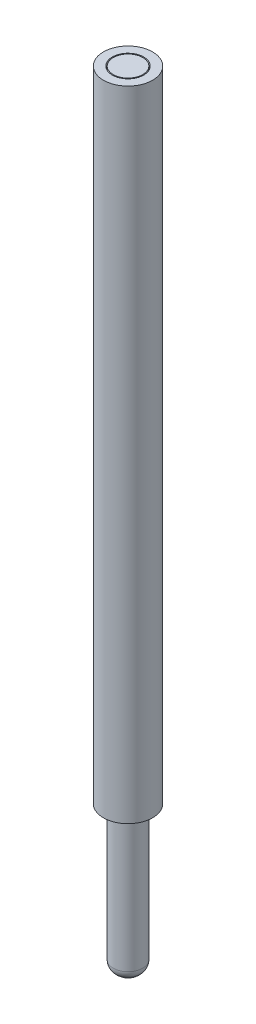
ISO-10303-21;
HEADER;
FILE_DESCRIPTION(('STEP AP214'),'2;1');
FILE_NAME('part.step','',(''),(''),'','','');
FILE_SCHEMA(('AUTOMOTIVE_DESIGN { 1 0 10303 214 1 1 1 1 }'));
ENDSEC;
DATA;
#1=APPLICATION_CONTEXT('core data for automotive mechanical design processes');
#2=APPLICATION_PROTOCOL_DEFINITION('international standard','automotive_design',2000,#1);
#3=PRODUCT_CONTEXT('',#1,'mechanical');
#4=PRODUCT('Part','Part','',(#3));
#5=PRODUCT_RELATED_PRODUCT_CATEGORY('part','',(#4));
#6=PRODUCT_DEFINITION_FORMATION('','',#4);
#7=PRODUCT_DEFINITION_CONTEXT('part definition',#1,'design');
#8=PRODUCT_DEFINITION('design','',#6,#7);
#9=PRODUCT_DEFINITION_SHAPE('','',#8);
#10=(LENGTH_UNIT() NAMED_UNIT(*) SI_UNIT(.MILLI.,.METRE.));
#11=(NAMED_UNIT(*) PLANE_ANGLE_UNIT() SI_UNIT($,.RADIAN.));
#12=(NAMED_UNIT(*) SI_UNIT($,.STERADIAN.) SOLID_ANGLE_UNIT());
#13=UNCERTAINTY_MEASURE_WITH_UNIT(LENGTH_MEASURE(1.E-05),#10,'distance_accuracy_value','');
#14=(GEOMETRIC_REPRESENTATION_CONTEXT(3) GLOBAL_UNCERTAINTY_ASSIGNED_CONTEXT((#13)) GLOBAL_UNIT_ASSIGNED_CONTEXT((#10,
#11,#12)) REPRESENTATION_CONTEXT('',''));
#15=CARTESIAN_POINT('',(0.,0.,0.));
#16=DIRECTION('',(0.,0.,1.));
#17=DIRECTION('',(1.,0.,0.));
#18=AXIS2_PLACEMENT_3D('',#15,#16,#17);
#19=CARTESIAN_POINT('',(0.,0.,0.));
#20=DIRECTION('',(0.,-1.,0.));
#21=DIRECTION('',(0.,0.,-1.));
#22=AXIS2_PLACEMENT_3D('',#19,#20,#21);
#23=CYLINDRICAL_SURFACE('',#22,0.799999999999999);
#24=CARTESIAN_POINT('',(0.,7.5,0.));
#25=DIRECTION('',(0.,-1.,0.));
#26=DIRECTION('',(0.,0.,-1.));
#27=AXIS2_PLACEMENT_3D('',#24,#25,#26);
#28=CIRCLE('',#27,0.800000000000001);
#29=CARTESIAN_POINT('',(0.,7.5,-0.800000000000001));
#30=VERTEX_POINT('',#29);
#31=EDGE_CURVE('E11',#30,#30,#28,.T.);
#32=ORIENTED_EDGE('',*,*,#31,.T.);
#33=EDGE_LOOP('',(#32));
#34=FACE_BOUND('',#33,.T.);
#35=CARTESIAN_POINT('',(0.,40.,0.));
#36=DIRECTION('',(0.,-1.,0.));
#37=DIRECTION('',(0.,0.,-1.));
#38=AXIS2_PLACEMENT_3D('',#35,#36,#37);
#39=CIRCLE('',#38,0.799999999999997);
#40=CARTESIAN_POINT('',(0.,40.,-0.799999999999997));
#41=VERTEX_POINT('',#40);
#42=EDGE_CURVE('E54',#41,#41,#39,.T.);
#43=ORIENTED_EDGE('',*,*,#42,.F.);
#44=EDGE_LOOP('',(#43));
#45=FACE_BOUND('',#44,.T.);
#46=ADVANCED_FACE('F40',(#34,#45),#23,.F.);
#47=CARTESIAN_POINT('',(0.800000000000001,7.5,0.));
#48=DIRECTION('',(0.,-1.,0.));
#49=DIRECTION('',(0.,0.,-1.));
#50=AXIS2_PLACEMENT_3D('',#47,#48,#49);
#51=PLANE('',#50);
#52=CARTESIAN_POINT('',(0.,7.5,0.));
#53=DIRECTION('',(0.,-1.,0.));
#54=DIRECTION('',(0.,0.,-1.));
#55=AXIS2_PLACEMENT_3D('',#52,#53,#54);
#56=CIRCLE('',#55,1.25);
#57=CARTESIAN_POINT('',(0.,7.5,-1.25));
#58=VERTEX_POINT('',#57);
#59=EDGE_CURVE('E46',#58,#58,#56,.T.);
#60=ORIENTED_EDGE('',*,*,#59,.T.);
#61=EDGE_LOOP('',(#60));
#62=FACE_BOUND('',#61,.T.);
#63=ORIENTED_EDGE('',*,*,#31,.F.);
#64=EDGE_LOOP('',(#63));
#65=FACE_BOUND('',#64,.T.);
#66=ADVANCED_FACE('F64',(#62,#65),#51,.T.);
#67=CARTESIAN_POINT('',(0.,0.,0.));
#68=DIRECTION('',(0.,-1.,0.));
#69=DIRECTION('',(0.,0.,-1.));
#70=AXIS2_PLACEMENT_3D('',#67,#68,#69);
#71=CYLINDRICAL_SURFACE('',#70,1.25);
#72=CARTESIAN_POINT('',(0.,40.,0.));
#73=DIRECTION('',(0.,-1.,0.));
#74=DIRECTION('',(0.,0.,-1.));
#75=AXIS2_PLACEMENT_3D('',#72,#73,#74);
#76=CIRCLE('',#75,1.25);
#77=CARTESIAN_POINT('',(0.,40.,-1.25));
#78=VERTEX_POINT('',#77);
#79=EDGE_CURVE('E50',#78,#78,#76,.T.);
#80=ORIENTED_EDGE('',*,*,#79,.T.);
#81=EDGE_LOOP('',(#80));
#82=FACE_BOUND('',#81,.T.);
#83=ORIENTED_EDGE('',*,*,#59,.F.);
#84=EDGE_LOOP('',(#83));
#85=FACE_BOUND('',#84,.T.);
#86=ADVANCED_FACE('F68',(#82,#85),#71,.T.);
#87=CARTESIAN_POINT('',(0.799999999999997,40.,0.));
#88=DIRECTION('',(0.,1.,0.));
#89=DIRECTION('',(0.,0.,1.));
#90=AXIS2_PLACEMENT_3D('',#87,#88,#89);
#91=PLANE('',#90);
#92=ORIENTED_EDGE('',*,*,#42,.T.);
#93=EDGE_LOOP('',(#92));
#94=FACE_BOUND('',#93,.T.);
#95=ORIENTED_EDGE('',*,*,#79,.F.);
#96=EDGE_LOOP('',(#95));
#97=FACE_BOUND('',#96,.T.);
#98=ADVANCED_FACE('F60',(#94,#97),#91,.T.);
#99=CLOSED_SHELL('',(#46,#66,#86,#98));
#100=MANIFOLD_SOLID_BREP('B2',#99);
#101=CARTESIAN_POINT('',(0.,0.812500000000001,0.));
#102=DIRECTION('',(0.,-1.,0.));
#103=DIRECTION('',(-1.,0.,0.));
#104=AXIS2_PLACEMENT_3D('',#101,#102,#103);
#105=SPHERICAL_SURFACE('',#104,0.812500000000001);
#106=CARTESIAN_POINT('',(0.,0.324999999999994,0.));
#107=DIRECTION('',(0.,1.,0.));
#108=DIRECTION('',(0.,0.,1.));
#109=AXIS2_PLACEMENT_3D('',#106,#107,#108);
#110=CIRCLE('',#109,0.649999999999996);
#111=CARTESIAN_POINT('',(0.,0.324999999999994,0.649999999999996));
#112=VERTEX_POINT('',#111);
#113=EDGE_CURVE('E108',#112,#112,#110,.F.);
#114=ORIENTED_EDGE('',*,*,#113,.T.);
#115=EDGE_LOOP('',(#114));
#116=FACE_BOUND('',#115,.T.);
#117=ADVANCED_FACE('F101',(#116),#105,.T.);
#118=CARTESIAN_POINT('',(0.,0.,0.));
#119=DIRECTION('',(0.,-1.,0.));
#120=DIRECTION('',(0.,0.,-1.));
#121=AXIS2_PLACEMENT_3D('',#118,#119,#120);
#122=CYLINDRICAL_SURFACE('',#121,0.749999999999999);
#123=CARTESIAN_POINT('',(0.,0.624999999999998,0.));
#124=DIRECTION('',(0.,1.,0.));
#125=DIRECTION('',(0.,0.,1.));
#126=AXIS2_PLACEMENT_3D('',#123,#124,#125);
#127=CIRCLE('',#126,0.749999999999999);
#128=CARTESIAN_POINT('',(0.,0.624999999999998,0.749999999999999));
#129=VERTEX_POINT('',#128);
#130=EDGE_CURVE('E39',#129,#129,#127,.T.);
#131=ORIENTED_EDGE('',*,*,#130,.T.);
#132=EDGE_LOOP('',(#131));
#133=FACE_BOUND('',#132,.T.);
#134=CARTESIAN_POINT('',(0.,40.,0.));
#135=DIRECTION('',(0.,-1.,0.));
#136=DIRECTION('',(0.,0.,-1.));
#137=AXIS2_PLACEMENT_3D('',#134,#135,#136);
#138=CIRCLE('',#137,0.749999999999997);
#139=CARTESIAN_POINT('',(0.,40.,-0.749999999999997));
#140=VERTEX_POINT('',#139);
#141=EDGE_CURVE('E112',#140,#140,#138,.T.);
#142=ORIENTED_EDGE('',*,*,#141,.T.);
#143=EDGE_LOOP('',(#142));
#144=FACE_BOUND('',#143,.T.);
#145=ADVANCED_FACE('F119',(#133,#144),#122,.T.);
#146=CARTESIAN_POINT('',(0.,40.,0.));
#147=DIRECTION('',(0.,1.,0.));
#148=DIRECTION('',(0.,0.,1.));
#149=AXIS2_PLACEMENT_3D('',#146,#147,#148);
#150=PLANE('',#149);
#151=ORIENTED_EDGE('',*,*,#141,.F.);
#152=EDGE_LOOP('',(#151));
#153=FACE_BOUND('',#152,.T.);
#154=ADVANCED_FACE('F121',(#153),#150,.T.);
#155=CARTESIAN_POINT('',(0.,0.624999999999998,0.));
#156=DIRECTION('',(0.,1.,0.));
#157=DIRECTION('',(0.,0.,1.));
#158=AXIS2_PLACEMENT_3D('',#155,#156,#157);
#159=DEGENERATE_TOROIDAL_SURFACE('',#158,0.249999999999999,0.5,.T.);
#160=ORIENTED_EDGE('',*,*,#130,.F.);
#161=EDGE_LOOP('',(#160));
#162=FACE_BOUND('',#161,.T.);
#163=ORIENTED_EDGE('',*,*,#113,.F.);
#164=EDGE_LOOP('',(#163));
#165=FACE_BOUND('',#164,.T.);
#166=ADVANCED_FACE('F103',(#162,#165),#159,.T.);
#167=CLOSED_SHELL('',(#117,#145,#154,#166));
#168=MANIFOLD_SOLID_BREP('B6',#167);
#169=ADVANCED_BREP_SHAPE_REPRESENTATION('',(#18,#100,#168),#14);
#170=SHAPE_DEFINITION_REPRESENTATION(#9,#169);
ENDSEC;
END-ISO-10303-21;
